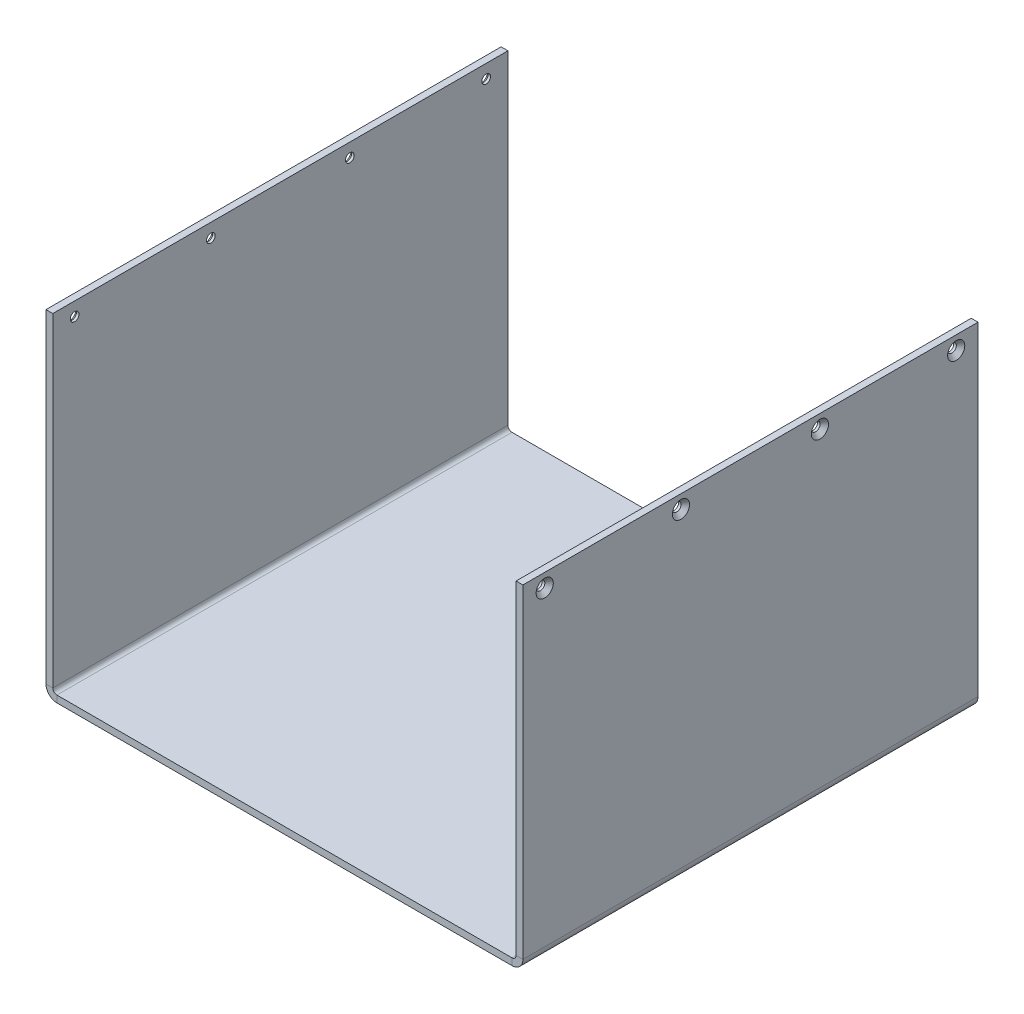
ISO-10303-21;
HEADER;
FILE_DESCRIPTION(('STEP AP214'),'2;1');
FILE_NAME('part.step','',(''),(''),'','','');
FILE_SCHEMA(('AUTOMOTIVE_DESIGN { 1 0 10303 214 1 1 1 1 }'));
ENDSEC;
DATA;
#1=APPLICATION_CONTEXT('core data for automotive mechanical design processes');
#2=APPLICATION_PROTOCOL_DEFINITION('international standard','automotive_design',2000,#1);
#3=PRODUCT_CONTEXT('',#1,'mechanical');
#4=PRODUCT('Part','Part','',(#3));
#5=PRODUCT_RELATED_PRODUCT_CATEGORY('part','',(#4));
#6=PRODUCT_DEFINITION_FORMATION('','',#4);
#7=PRODUCT_DEFINITION_CONTEXT('part definition',#1,'design');
#8=PRODUCT_DEFINITION('design','',#6,#7);
#9=PRODUCT_DEFINITION_SHAPE('','',#8);
#10=(LENGTH_UNIT() NAMED_UNIT(*) SI_UNIT(.MILLI.,.METRE.));
#11=(NAMED_UNIT(*) PLANE_ANGLE_UNIT() SI_UNIT($,.RADIAN.));
#12=(NAMED_UNIT(*) SI_UNIT($,.STERADIAN.) SOLID_ANGLE_UNIT());
#13=UNCERTAINTY_MEASURE_WITH_UNIT(LENGTH_MEASURE(1.E-05),#10,'distance_accuracy_value','');
#14=(GEOMETRIC_REPRESENTATION_CONTEXT(3) GLOBAL_UNCERTAINTY_ASSIGNED_CONTEXT((#13)) GLOBAL_UNIT_ASSIGNED_CONTEXT((#10,
#11,#12)) REPRESENTATION_CONTEXT('',''));
#15=CARTESIAN_POINT('',(0.,0.,0.));
#16=DIRECTION('',(0.,0.,1.));
#17=DIRECTION('',(1.,0.,0.));
#18=AXIS2_PLACEMENT_3D('',#15,#16,#17);
#19=CARTESIAN_POINT('',(124.731404958678,-4.45121620737105E-13,0.));
#20=DIRECTION('',(-1.,0.,0.));
#21=DIRECTION('',(0.,-1.,0.));
#22=AXIS2_PLACEMENT_3D('',#19,#20,#21);
#23=PLANE('',#22);
#24=CARTESIAN_POINT('',(124.731404958678,115.5,27.2665289256198));
#25=DIRECTION('',(1.,0.,0.));
#26=DIRECTION('',(0.,0.,-1.));
#27=AXIS2_PLACEMENT_3D('',#24,#25,#26);
#28=CIRCLE('',#27,3.15);
#29=CARTESIAN_POINT('',(124.731404958678,115.5,24.1165289256198));
#30=VERTEX_POINT('',#29);
#31=EDGE_CURVE('E752',#30,#30,#28,.T.);
#32=ORIENTED_EDGE('',*,*,#31,.F.);
#33=EDGE_LOOP('',(#32));
#34=FACE_BOUND('',#33,.T.);
#35=CARTESIAN_POINT('',(124.731404958678,115.5,78.2665289256198));
#36=DIRECTION('',(1.,0.,0.));
#37=DIRECTION('',(0.,0.,-1.));
#38=AXIS2_PLACEMENT_3D('',#35,#36,#37);
#39=CIRCLE('',#38,3.15);
#40=CARTESIAN_POINT('',(124.731404958678,115.5,75.1165289256198));
#41=VERTEX_POINT('',#40);
#42=EDGE_CURVE('E743',#41,#41,#39,.T.);
#43=ORIENTED_EDGE('',*,*,#42,.F.);
#44=EDGE_LOOP('',(#43));
#45=FACE_BOUND('',#44,.T.);
#46=DIRECTION('',(0.,0.,1.));
#47=VECTOR('',#46,1.);
#48=CARTESIAN_POINT('',(124.731404958678,1.49999999999998,0.));
#49=LINE('',#48,#47);
#50=CARTESIAN_POINT('',(124.731404958678,1.49999999999998,-30.7334710743802));
#51=VERTEX_POINT('',#50);
#52=CARTESIAN_POINT('',(124.731404958678,1.49999999999999,136.26652892562));
#53=VERTEX_POINT('',#52);
#54=EDGE_CURVE('E136',#51,#53,#49,.T.);
#55=ORIENTED_EDGE('',*,*,#54,.F.);
#56=DIRECTION('',(0.,1.,0.));
#57=VECTOR('',#56,1.);
#58=CARTESIAN_POINT('',(124.731404958678,120.5,-30.7334710743802));
#59=LINE('',#58,#57);
#60=CARTESIAN_POINT('',(124.731404958678,120.5,-30.7334710743802));
#61=VERTEX_POINT('',#60);
#62=EDGE_CURVE('E157',#51,#61,#59,.T.);
#63=ORIENTED_EDGE('',*,*,#62,.T.);
#64=DIRECTION('',(0.,0.,1.));
#65=VECTOR('',#64,1.);
#66=CARTESIAN_POINT('',(124.731404958678,120.5,136.26652892562));
#67=LINE('',#66,#65);
#68=CARTESIAN_POINT('',(124.731404958678,120.5,136.26652892562));
#69=VERTEX_POINT('',#68);
#70=EDGE_CURVE('E167',#61,#69,#67,.T.);
#71=ORIENTED_EDGE('',*,*,#70,.T.);
#72=DIRECTION('',(0.,-1.,0.));
#73=VECTOR('',#72,1.);
#74=CARTESIAN_POINT('',(124.731404958678,0.,136.26652892562));
#75=LINE('',#74,#73);
#76=EDGE_CURVE('E160',#69,#53,#75,.T.);
#77=ORIENTED_EDGE('',*,*,#76,.T.);
#78=EDGE_LOOP('',(#55,#63,#71,#77));
#79=FACE_BOUND('',#78,.T.);
#80=CARTESIAN_POINT('',(124.731404958678,115.5,128.26652892562));
#81=DIRECTION('',(1.,0.,0.));
#82=DIRECTION('',(0.,0.,-1.));
#83=AXIS2_PLACEMENT_3D('',#80,#81,#82);
#84=CIRCLE('',#83,3.15);
#85=CARTESIAN_POINT('',(124.731404958678,115.5,125.11652892562));
#86=VERTEX_POINT('',#85);
#87=EDGE_CURVE('E734',#86,#86,#84,.T.);
#88=ORIENTED_EDGE('',*,*,#87,.F.);
#89=EDGE_LOOP('',(#88));
#90=FACE_BOUND('',#89,.T.);
#91=CARTESIAN_POINT('',(124.731404958678,115.5,-22.7334710743802));
#92=DIRECTION('',(1.,0.,0.));
#93=DIRECTION('',(0.,0.,-1.));
#94=AXIS2_PLACEMENT_3D('',#91,#92,#93);
#95=CIRCLE('',#94,3.15);
#96=CARTESIAN_POINT('',(124.731404958678,115.5,-25.8834710743802));
#97=VERTEX_POINT('',#96);
#98=EDGE_CURVE('E761',#97,#97,#95,.T.);
#99=ORIENTED_EDGE('',*,*,#98,.F.);
#100=EDGE_LOOP('',(#99));
#101=FACE_BOUND('',#100,.T.);
#102=ADVANCED_FACE('F40',(#34,#45,#79,#90,#101),#23,.F.);
#103=CARTESIAN_POINT('',(-50.2685950413223,-1.73771630947329E-13,0.));
#104=DIRECTION('',(1.,0.,0.));
#105=DIRECTION('',(0.,1.,0.));
#106=AXIS2_PLACEMENT_3D('',#103,#104,#105);
#107=PLANE('',#106);
#108=CARTESIAN_POINT('',(-50.2685950413227,115.5,128.26652892562));
#109=DIRECTION('',(-1.,0.,0.));
#110=DIRECTION('',(0.,0.,1.));
#111=AXIS2_PLACEMENT_3D('',#108,#109,#110);
#112=CIRCLE('',#111,3.15);
#113=CARTESIAN_POINT('',(-50.2685950413227,115.5,131.41652892562));
#114=VERTEX_POINT('',#113);
#115=EDGE_CURVE('E725',#114,#114,#112,.T.);
#116=ORIENTED_EDGE('',*,*,#115,.F.);
#117=EDGE_LOOP('',(#116));
#118=FACE_BOUND('',#117,.T.);
#119=CARTESIAN_POINT('',(-50.2685950413227,115.5,27.2665289256198));
#120=DIRECTION('',(-1.,0.,0.));
#121=DIRECTION('',(0.,0.,1.));
#122=AXIS2_PLACEMENT_3D('',#119,#120,#121);
#123=CIRCLE('',#122,3.15);
#124=CARTESIAN_POINT('',(-50.2685950413227,115.5,30.4165289256198));
#125=VERTEX_POINT('',#124);
#126=EDGE_CURVE('E707',#125,#125,#123,.T.);
#127=ORIENTED_EDGE('',*,*,#126,.F.);
#128=EDGE_LOOP('',(#127));
#129=FACE_BOUND('',#128,.T.);
#130=DIRECTION('',(0.,0.,-1.));
#131=VECTOR('',#130,1.);
#132=CARTESIAN_POINT('',(-50.2685950413223,1.49999999999998,0.));
#133=LINE('',#132,#131);
#134=CARTESIAN_POINT('',(-50.2685950413223,1.49999999999998,136.26652892562));
#135=VERTEX_POINT('',#134);
#136=CARTESIAN_POINT('',(-50.2685950413223,1.49999999999998,-30.7334710743802));
#137=VERTEX_POINT('',#136);
#138=EDGE_CURVE('E203',#135,#137,#133,.T.);
#139=ORIENTED_EDGE('',*,*,#138,.F.);
#140=DIRECTION('',(0.,1.,0.));
#141=VECTOR('',#140,1.);
#142=CARTESIAN_POINT('',(-50.2685950413227,120.5,136.26652892562));
#143=LINE('',#142,#141);
#144=CARTESIAN_POINT('',(-50.2685950413227,120.5,136.26652892562));
#145=VERTEX_POINT('',#144);
#146=EDGE_CURVE('E208',#135,#145,#143,.T.);
#147=ORIENTED_EDGE('',*,*,#146,.T.);
#148=DIRECTION('',(0.,0.,-1.));
#149=VECTOR('',#148,1.);
#150=CARTESIAN_POINT('',(-50.2685950413227,120.5,-30.7334710743802));
#151=LINE('',#150,#149);
#152=CARTESIAN_POINT('',(-50.2685950413227,120.5,-30.7334710743802));
#153=VERTEX_POINT('',#152);
#154=EDGE_CURVE('E210',#145,#153,#151,.T.);
#155=ORIENTED_EDGE('',*,*,#154,.T.);
#156=DIRECTION('',(0.,-1.,0.));
#157=VECTOR('',#156,1.);
#158=CARTESIAN_POINT('',(-50.2685950413223,0.,-30.7334710743802));
#159=LINE('',#158,#157);
#160=EDGE_CURVE('E213',#153,#137,#159,.T.);
#161=ORIENTED_EDGE('',*,*,#160,.T.);
#162=EDGE_LOOP('',(#139,#147,#155,#161));
#163=FACE_BOUND('',#162,.T.);
#164=CARTESIAN_POINT('',(-50.2685950413227,115.5,-22.7334710743802));
#165=DIRECTION('',(-1.,0.,0.));
#166=DIRECTION('',(0.,0.,1.));
#167=AXIS2_PLACEMENT_3D('',#164,#165,#166);
#168=CIRCLE('',#167,3.15);
#169=CARTESIAN_POINT('',(-50.2685950413227,115.5,-19.5834710743802));
#170=VERTEX_POINT('',#169);
#171=EDGE_CURVE('E698',#170,#170,#168,.T.);
#172=ORIENTED_EDGE('',*,*,#171,.F.);
#173=EDGE_LOOP('',(#172));
#174=FACE_BOUND('',#173,.T.);
#175=CARTESIAN_POINT('',(-50.2685950413227,115.5,78.2665289256198));
#176=DIRECTION('',(-1.,0.,0.));
#177=DIRECTION('',(0.,0.,1.));
#178=AXIS2_PLACEMENT_3D('',#175,#176,#177);
#179=CIRCLE('',#178,3.15);
#180=CARTESIAN_POINT('',(-50.2685950413227,115.5,81.4165289256198));
#181=VERTEX_POINT('',#180);
#182=EDGE_CURVE('E716',#181,#181,#179,.T.);
#183=ORIENTED_EDGE('',*,*,#182,.F.);
#184=EDGE_LOOP('',(#183));
#185=FACE_BOUND('',#184,.T.);
#186=ADVANCED_FACE('F267',(#118,#129,#163,#174,#185),#107,.F.);
#187=CARTESIAN_POINT('',(0.,-2.5,0.));
#188=DIRECTION('',(0.,1.,0.));
#189=DIRECTION('',(0.,0.,1.));
#190=AXIS2_PLACEMENT_3D('',#187,#188,#189);
#191=PLANE('',#190);
#192=DIRECTION('',(0.,0.,-1.));
#193=VECTOR('',#192,1.);
#194=CARTESIAN_POINT('',(120.731404958678,-2.50000000000004,-30.7334710743802));
#195=LINE('',#194,#193);
#196=CARTESIAN_POINT('',(120.731404958678,-2.50000000000004,-30.7334710743802));
#197=VERTEX_POINT('',#196);
#198=CARTESIAN_POINT('',(120.731404958678,-2.5,136.26652892562));
#199=VERTEX_POINT('',#198);
#200=EDGE_CURVE('E138',#197,#199,#195,.F.);
#201=ORIENTED_EDGE('',*,*,#200,.T.);
#202=DIRECTION('',(1.,0.,0.));
#203=VECTOR('',#202,1.);
#204=CARTESIAN_POINT('',(-47.7685950413223,-2.5,136.26652892562));
#205=LINE('',#204,#203);
#206=CARTESIAN_POINT('',(-46.2685950413223,-2.50000000000003,136.26652892562));
#207=VERTEX_POINT('',#206);
#208=EDGE_CURVE('E49',#207,#199,#205,.T.);
#209=ORIENTED_EDGE('',*,*,#208,.F.);
#210=DIRECTION('',(0.,0.,1.));
#211=VECTOR('',#210,1.);
#212=CARTESIAN_POINT('',(-46.2685950413223,-2.50000000000003,136.26652892562));
#213=LINE('',#212,#211);
#214=CARTESIAN_POINT('',(-46.2685950413223,-2.5,-30.7334710743802));
#215=VERTEX_POINT('',#214);
#216=EDGE_CURVE('E228',#207,#215,#213,.F.);
#217=ORIENTED_EDGE('',*,*,#216,.T.);
#218=DIRECTION('',(-1.,0.,0.));
#219=VECTOR('',#218,1.);
#220=CARTESIAN_POINT('',(-47.7685950413223,-2.5,-30.7334710743802));
#221=LINE('',#220,#219);
#222=EDGE_CURVE('E11',#197,#215,#221,.T.);
#223=ORIENTED_EDGE('',*,*,#222,.F.);
#224=EDGE_LOOP('',(#201,#209,#217,#223));
#225=FACE_BOUND('',#224,.T.);
#226=ADVANCED_FACE('F302',(#225),#191,.F.);
#227=CARTESIAN_POINT('',(0.,0.,0.));
#228=DIRECTION('',(0.,1.,0.));
#229=DIRECTION('',(0.,0.,1.));
#230=AXIS2_PLACEMENT_3D('',#227,#228,#229);
#231=PLANE('',#230);
#232=DIRECTION('',(1.,0.,0.));
#233=VECTOR('',#232,1.);
#234=CARTESIAN_POINT('',(-47.7685950413223,0.,136.26652892562));
#235=LINE('',#234,#233);
#236=CARTESIAN_POINT('',(-46.2685950413223,0.,136.26652892562));
#237=VERTEX_POINT('',#236);
#238=CARTESIAN_POINT('',(120.731404958678,0.,136.26652892562));
#239=VERTEX_POINT('',#238);
#240=EDGE_CURVE('E246',#237,#239,#235,.T.);
#241=ORIENTED_EDGE('',*,*,#240,.T.);
#242=DIRECTION('',(0.,0.,-1.));
#243=VECTOR('',#242,1.);
#244=CARTESIAN_POINT('',(120.731404958678,0.,-30.7334710743802));
#245=LINE('',#244,#243);
#246=CARTESIAN_POINT('',(120.731404958678,0.,-30.7334710743802));
#247=VERTEX_POINT('',#246);
#248=EDGE_CURVE('E189',#247,#239,#245,.F.);
#249=ORIENTED_EDGE('',*,*,#248,.F.);
#250=DIRECTION('',(-1.,0.,0.));
#251=VECTOR('',#250,1.);
#252=CARTESIAN_POINT('',(-47.7685950413223,0.,-30.7334710743802));
#253=LINE('',#252,#251);
#254=CARTESIAN_POINT('',(-46.2685950413223,0.,-30.7334710743802));
#255=VERTEX_POINT('',#254);
#256=EDGE_CURVE('E44',#247,#255,#253,.T.);
#257=ORIENTED_EDGE('',*,*,#256,.T.);
#258=DIRECTION('',(0.,0.,1.));
#259=VECTOR('',#258,1.);
#260=CARTESIAN_POINT('',(-46.2685950413223,0.,136.26652892562));
#261=LINE('',#260,#259);
#262=EDGE_CURVE('E57',#237,#255,#261,.F.);
#263=ORIENTED_EDGE('',*,*,#262,.F.);
#264=EDGE_LOOP('',(#241,#249,#257,#263));
#265=FACE_BOUND('',#264,.T.);
#266=ADVANCED_FACE('F251',(#265),#231,.T.);
#267=CARTESIAN_POINT('',(-47.7685950413223,-2.5,-30.7334710743802));
#268=DIRECTION('',(0.,0.,-1.));
#269=DIRECTION('',(-1.,0.,0.));
#270=AXIS2_PLACEMENT_3D('',#267,#268,#269);
#271=PLANE('',#270);
#272=ORIENTED_EDGE('',*,*,#256,.F.);
#273=DIRECTION('',(0.,-1.,0.));
#274=VECTOR('',#273,1.);
#275=CARTESIAN_POINT('',(120.731404958678,0.,-30.7334710743802));
#276=LINE('',#275,#274);
#277=EDGE_CURVE('E185',#247,#197,#276,.T.);
#278=ORIENTED_EDGE('',*,*,#277,.T.);
#279=ORIENTED_EDGE('',*,*,#222,.T.);
#280=DIRECTION('',(0.,-1.,0.));
#281=VECTOR('',#280,1.);
#282=CARTESIAN_POINT('',(-46.2685950413223,0.,-30.7334710743802));
#283=LINE('',#282,#281);
#284=EDGE_CURVE('E243',#255,#215,#283,.T.);
#285=ORIENTED_EDGE('',*,*,#284,.F.);
#286=EDGE_LOOP('',(#272,#278,#279,#285));
#287=FACE_BOUND('',#286,.T.);
#288=ADVANCED_FACE('F252',(#287),#271,.T.);
#289=CARTESIAN_POINT('',(-47.7685950413223,-2.5,136.26652892562));
#290=DIRECTION('',(0.,0.,1.));
#291=DIRECTION('',(1.,0.,0.));
#292=AXIS2_PLACEMENT_3D('',#289,#290,#291);
#293=PLANE('',#292);
#294=DIRECTION('',(0.,-1.,0.));
#295=VECTOR('',#294,1.);
#296=CARTESIAN_POINT('',(120.731404958678,0.,136.26652892562));
#297=LINE('',#296,#295);
#298=EDGE_CURVE('E193',#239,#199,#297,.T.);
#299=ORIENTED_EDGE('',*,*,#298,.F.);
#300=ORIENTED_EDGE('',*,*,#240,.F.);
#301=DIRECTION('',(0.,-1.,0.));
#302=VECTOR('',#301,1.);
#303=CARTESIAN_POINT('',(-46.2685950413223,0.,136.26652892562));
#304=LINE('',#303,#302);
#305=EDGE_CURVE('E234',#237,#207,#304,.T.);
#306=ORIENTED_EDGE('',*,*,#305,.T.);
#307=ORIENTED_EDGE('',*,*,#208,.T.);
#308=EDGE_LOOP('',(#299,#300,#306,#307));
#309=FACE_BOUND('',#308,.T.);
#310=ADVANCED_FACE('F42',(#309),#293,.T.);
#311=CARTESIAN_POINT('',(-46.2685950413223,1.5,-30.7334710743802));
#312=DIRECTION('',(0.,0.,-1.));
#313=DIRECTION('',(-1.,0.,0.));
#314=AXIS2_PLACEMENT_3D('',#311,#312,#313);
#315=PLANE('',#314);
#316=DIRECTION('',(-1.,0.,0.));
#317=VECTOR('',#316,1.);
#318=CARTESIAN_POINT('',(-47.7685950413223,1.49999999999999,-30.7334710743802));
#319=LINE('',#318,#317);
#320=CARTESIAN_POINT('',(-47.7685950413223,1.49999999999999,-30.7334710743802));
#321=VERTEX_POINT('',#320);
#322=EDGE_CURVE('E196',#321,#137,#319,.T.);
#323=ORIENTED_EDGE('',*,*,#322,.F.);
#324=CARTESIAN_POINT('',(-46.2685950413223,1.5,-30.7334710743802));
#325=DIRECTION('',(0.,0.,1.));
#326=DIRECTION('',(1.,0.,0.));
#327=AXIS2_PLACEMENT_3D('',#324,#325,#326);
#328=CIRCLE('',#327,1.50000000000002);
#329=EDGE_CURVE('E237',#255,#321,#328,.F.);
#330=ORIENTED_EDGE('',*,*,#329,.F.);
#331=ORIENTED_EDGE('',*,*,#284,.T.);
#332=CARTESIAN_POINT('',(-46.2685950413223,1.5,-30.7334710743802));
#333=DIRECTION('',(0.,0.,1.));
#334=DIRECTION('',(1.,0.,0.));
#335=AXIS2_PLACEMENT_3D('',#332,#333,#334);
#336=CIRCLE('',#335,4.00000000000002);
#337=EDGE_CURVE('E230',#215,#137,#336,.F.);
#338=ORIENTED_EDGE('',*,*,#337,.T.);
#339=EDGE_LOOP('',(#323,#330,#331,#338));
#340=FACE_BOUND('',#339,.T.);
#341=ADVANCED_FACE('F260',(#340),#315,.T.);
#342=CARTESIAN_POINT('',(-46.2685950413223,1.5,136.26652892562));
#343=DIRECTION('',(0.,0.,-1.));
#344=DIRECTION('',(-1.,0.,0.));
#345=AXIS2_PLACEMENT_3D('',#342,#343,#344);
#346=PLANE('',#345);
#347=CARTESIAN_POINT('',(-46.2685950413223,1.5,136.26652892562));
#348=DIRECTION('',(0.,0.,1.));
#349=DIRECTION('',(1.,0.,0.));
#350=AXIS2_PLACEMENT_3D('',#347,#348,#349);
#351=CIRCLE('',#350,1.50000000000002);
#352=CARTESIAN_POINT('',(-47.7685950413223,1.49999999999999,136.26652892562));
#353=VERTEX_POINT('',#352);
#354=EDGE_CURVE('E227',#353,#237,#351,.T.);
#355=ORIENTED_EDGE('',*,*,#354,.F.);
#356=DIRECTION('',(-1.,0.,0.));
#357=VECTOR('',#356,1.);
#358=CARTESIAN_POINT('',(-47.7685950413223,1.49999999999999,136.26652892562));
#359=LINE('',#358,#357);
#360=EDGE_CURVE('E200',#353,#135,#359,.T.);
#361=ORIENTED_EDGE('',*,*,#360,.T.);
#362=CARTESIAN_POINT('',(-46.2685950413223,1.5,136.26652892562));
#363=DIRECTION('',(0.,0.,1.));
#364=DIRECTION('',(1.,0.,0.));
#365=AXIS2_PLACEMENT_3D('',#362,#363,#364);
#366=CIRCLE('',#365,4.00000000000002);
#367=EDGE_CURVE('E231',#135,#207,#366,.T.);
#368=ORIENTED_EDGE('',*,*,#367,.T.);
#369=ORIENTED_EDGE('',*,*,#305,.F.);
#370=EDGE_LOOP('',(#355,#361,#368,#369));
#371=FACE_BOUND('',#370,.T.);
#372=ADVANCED_FACE('F282',(#371),#346,.F.);
#373=CARTESIAN_POINT('',(-46.2685950413223,1.5,136.26652892562));
#374=DIRECTION('',(0.,0.,1.));
#375=DIRECTION('',(-1.,0.,0.));
#376=AXIS2_PLACEMENT_3D('',#373,#374,#375);
#377=CYLINDRICAL_SURFACE('',#376,4.00000000000002);
#378=ORIENTED_EDGE('',*,*,#216,.F.);
#379=ORIENTED_EDGE('',*,*,#367,.F.);
#380=ORIENTED_EDGE('',*,*,#138,.T.);
#381=ORIENTED_EDGE('',*,*,#337,.F.);
#382=EDGE_LOOP('',(#378,#379,#380,#381));
#383=FACE_BOUND('',#382,.T.);
#384=ADVANCED_FACE('F292',(#383),#377,.T.);
#385=CARTESIAN_POINT('',(-46.2685950413223,1.5,136.26652892562));
#386=DIRECTION('',(0.,0.,1.));
#387=DIRECTION('',(-1.,0.,0.));
#388=AXIS2_PLACEMENT_3D('',#385,#386,#387);
#389=CYLINDRICAL_SURFACE('',#388,1.50000000000002);
#390=ORIENTED_EDGE('',*,*,#262,.T.);
#391=ORIENTED_EDGE('',*,*,#329,.T.);
#392=DIRECTION('',(0.,0.,1.));
#393=VECTOR('',#392,1.);
#394=CARTESIAN_POINT('',(-47.7685950413223,1.49999999999999,-30.7334710743802));
#395=LINE('',#394,#393);
#396=EDGE_CURVE('E198',#321,#353,#395,.T.);
#397=ORIENTED_EDGE('',*,*,#396,.T.);
#398=ORIENTED_EDGE('',*,*,#354,.T.);
#399=EDGE_LOOP('',(#390,#391,#397,#398));
#400=FACE_BOUND('',#399,.T.);
#401=ADVANCED_FACE('F257',(#400),#389,.F.);
#402=CARTESIAN_POINT('',(-50.2685950413227,120.5,136.26652892562));
#403=DIRECTION('',(0.,0.,-1.));
#404=DIRECTION('',(-1.,0.,0.));
#405=AXIS2_PLACEMENT_3D('',#402,#403,#404);
#406=PLANE('',#405);
#407=ORIENTED_EDGE('',*,*,#360,.F.);
#408=DIRECTION('',(0.,1.,0.));
#409=VECTOR('',#408,1.);
#410=CARTESIAN_POINT('',(-47.7685950413227,120.5,136.26652892562));
#411=LINE('',#410,#409);
#412=CARTESIAN_POINT('',(-47.7685950413227,120.5,136.26652892562));
#413=VERTEX_POINT('',#412);
#414=EDGE_CURVE('E207',#353,#413,#411,.T.);
#415=ORIENTED_EDGE('',*,*,#414,.T.);
#416=DIRECTION('',(1.,0.,0.));
#417=VECTOR('',#416,1.);
#418=CARTESIAN_POINT('',(-50.2685950413227,120.5,136.26652892562));
#419=LINE('',#418,#417);
#420=EDGE_CURVE('E224',#145,#413,#419,.T.);
#421=ORIENTED_EDGE('',*,*,#420,.F.);
#422=ORIENTED_EDGE('',*,*,#146,.F.);
#423=EDGE_LOOP('',(#407,#415,#421,#422));
#424=FACE_BOUND('',#423,.T.);
#425=ADVANCED_FACE('F284',(#424),#406,.F.);
#426=CARTESIAN_POINT('',(-50.2685950413223,0.,-30.7334710743802));
#427=DIRECTION('',(0.,0.,1.));
#428=DIRECTION('',(1.,0.,0.));
#429=AXIS2_PLACEMENT_3D('',#426,#427,#428);
#430=PLANE('',#429);
#431=ORIENTED_EDGE('',*,*,#322,.T.);
#432=ORIENTED_EDGE('',*,*,#160,.F.);
#433=DIRECTION('',(1.,0.,0.));
#434=VECTOR('',#433,1.);
#435=CARTESIAN_POINT('',(-50.2685950413227,120.5,-30.7334710743802));
#436=LINE('',#435,#434);
#437=CARTESIAN_POINT('',(-47.7685950413227,120.5,-30.7334710743802));
#438=VERTEX_POINT('',#437);
#439=EDGE_CURVE('E216',#153,#438,#436,.T.);
#440=ORIENTED_EDGE('',*,*,#439,.T.);
#441=DIRECTION('',(0.,-1.,0.));
#442=VECTOR('',#441,1.);
#443=CARTESIAN_POINT('',(-47.7685950413223,0.,-30.7334710743802));
#444=LINE('',#443,#442);
#445=EDGE_CURVE('E211',#438,#321,#444,.T.);
#446=ORIENTED_EDGE('',*,*,#445,.T.);
#447=EDGE_LOOP('',(#431,#432,#440,#446));
#448=FACE_BOUND('',#447,.T.);
#449=ADVANCED_FACE('F263',(#448),#430,.F.);
#450=CARTESIAN_POINT('',(-47.7685950413223,-1.65042927600221E-13,0.));
#451=DIRECTION('',(1.,0.,0.));
#452=DIRECTION('',(0.,1.,0.));
#453=AXIS2_PLACEMENT_3D('',#450,#451,#452);
#454=PLANE('',#453);
#455=CARTESIAN_POINT('',(-47.7685950413227,115.5,128.26652892562));
#456=DIRECTION('',(1.,0.,0.));
#457=DIRECTION('',(0.,1.,0.));
#458=AXIS2_PLACEMENT_3D('',#455,#456,#457);
#459=CIRCLE('',#458,1.6);
#460=CARTESIAN_POINT('',(-47.7685950413227,117.1,128.26652892562));
#461=VERTEX_POINT('',#460);
#462=EDGE_CURVE('E719',#461,#461,#459,.T.);
#463=ORIENTED_EDGE('',*,*,#462,.F.);
#464=EDGE_LOOP('',(#463));
#465=FACE_BOUND('',#464,.T.);
#466=CARTESIAN_POINT('',(-47.7685950413227,115.5,78.2665289256198));
#467=DIRECTION('',(1.,0.,0.));
#468=DIRECTION('',(0.,1.,0.));
#469=AXIS2_PLACEMENT_3D('',#466,#467,#468);
#470=CIRCLE('',#469,1.6);
#471=CARTESIAN_POINT('',(-47.7685950413227,117.1,78.2665289256198));
#472=VERTEX_POINT('',#471);
#473=EDGE_CURVE('E710',#472,#472,#470,.T.);
#474=ORIENTED_EDGE('',*,*,#473,.F.);
#475=EDGE_LOOP('',(#474));
#476=FACE_BOUND('',#475,.T.);
#477=CARTESIAN_POINT('',(-47.7685950413227,115.5,27.2665289256198));
#478=DIRECTION('',(1.,0.,0.));
#479=DIRECTION('',(0.,1.,0.));
#480=AXIS2_PLACEMENT_3D('',#477,#478,#479);
#481=CIRCLE('',#480,1.6);
#482=CARTESIAN_POINT('',(-47.7685950413227,117.1,27.2665289256198));
#483=VERTEX_POINT('',#482);
#484=EDGE_CURVE('E701',#483,#483,#481,.T.);
#485=ORIENTED_EDGE('',*,*,#484,.F.);
#486=EDGE_LOOP('',(#485));
#487=FACE_BOUND('',#486,.T.);
#488=CARTESIAN_POINT('',(-47.7685950413227,115.5,-22.7334710743802));
#489=DIRECTION('',(1.,0.,0.));
#490=DIRECTION('',(0.,1.,0.));
#491=AXIS2_PLACEMENT_3D('',#488,#489,#490);
#492=CIRCLE('',#491,1.6);
#493=CARTESIAN_POINT('',(-47.7685950413227,117.1,-22.7334710743802));
#494=VERTEX_POINT('',#493);
#495=EDGE_CURVE('E691',#494,#494,#492,.T.);
#496=ORIENTED_EDGE('',*,*,#495,.F.);
#497=EDGE_LOOP('',(#496));
#498=FACE_BOUND('',#497,.T.);
#499=ORIENTED_EDGE('',*,*,#414,.F.);
#500=ORIENTED_EDGE('',*,*,#396,.F.);
#501=ORIENTED_EDGE('',*,*,#445,.F.);
#502=DIRECTION('',(0.,0.,-1.));
#503=VECTOR('',#502,1.);
#504=CARTESIAN_POINT('',(-47.7685950413227,120.5,-30.7334710743802));
#505=LINE('',#504,#503);
#506=EDGE_CURVE('E218',#413,#438,#505,.T.);
#507=ORIENTED_EDGE('',*,*,#506,.F.);
#508=EDGE_LOOP('',(#499,#500,#501,#507));
#509=FACE_BOUND('',#508,.T.);
#510=ADVANCED_FACE('F278',(#465,#476,#487,#498,#509),#454,.T.);
#511=CARTESIAN_POINT('',(-50.2685950413227,120.5,-30.7334710743802));
#512=DIRECTION('',(0.,-1.,0.));
#513=DIRECTION('',(1.,0.,0.));
#514=AXIS2_PLACEMENT_3D('',#511,#512,#513);
#515=PLANE('',#514);
#516=ORIENTED_EDGE('',*,*,#506,.T.);
#517=ORIENTED_EDGE('',*,*,#439,.F.);
#518=ORIENTED_EDGE('',*,*,#154,.F.);
#519=ORIENTED_EDGE('',*,*,#420,.T.);
#520=EDGE_LOOP('',(#516,#517,#518,#519));
#521=FACE_BOUND('',#520,.T.);
#522=ADVANCED_FACE('F274',(#521),#515,.F.);
#523=CARTESIAN_POINT('',(120.731404958678,1.50000000000001,136.26652892562));
#524=DIRECTION('',(0.,0.,1.));
#525=DIRECTION('',(0.,-1.,0.));
#526=AXIS2_PLACEMENT_3D('',#523,#524,#525);
#527=PLANE('',#526);
#528=DIRECTION('',(1.,0.,0.));
#529=VECTOR('',#528,1.);
#530=CARTESIAN_POINT('',(122.231404958678,1.5,136.26652892562));
#531=LINE('',#530,#529);
#532=CARTESIAN_POINT('',(122.231404958678,1.5,136.26652892562));
#533=VERTEX_POINT('',#532);
#534=EDGE_CURVE('E684',#533,#53,#531,.T.);
#535=ORIENTED_EDGE('',*,*,#534,.F.);
#536=CARTESIAN_POINT('',(120.731404958678,1.50000000000001,136.26652892562));
#537=DIRECTION('',(0.,0.,-1.));
#538=DIRECTION('',(0.,1.,0.));
#539=AXIS2_PLACEMENT_3D('',#536,#537,#538);
#540=CIRCLE('',#539,1.50000000000003);
#541=EDGE_CURVE('E141',#239,#533,#540,.F.);
#542=ORIENTED_EDGE('',*,*,#541,.F.);
#543=ORIENTED_EDGE('',*,*,#298,.T.);
#544=CARTESIAN_POINT('',(120.731404958678,1.50000000000001,136.26652892562));
#545=DIRECTION('',(0.,0.,-1.));
#546=DIRECTION('',(0.,1.,0.));
#547=AXIS2_PLACEMENT_3D('',#544,#545,#546);
#548=CIRCLE('',#547,4.00000000000003);
#549=EDGE_CURVE('E184',#199,#53,#548,.F.);
#550=ORIENTED_EDGE('',*,*,#549,.T.);
#551=EDGE_LOOP('',(#535,#542,#543,#550));
#552=FACE_BOUND('',#551,.T.);
#553=ADVANCED_FACE('F331',(#552),#527,.T.);
#554=CARTESIAN_POINT('',(120.731404958678,1.49999999999999,-30.7334710743802));
#555=DIRECTION('',(0.,0.,1.));
#556=DIRECTION('',(0.,-1.,0.));
#557=AXIS2_PLACEMENT_3D('',#554,#555,#556);
#558=PLANE('',#557);
#559=CARTESIAN_POINT('',(120.731404958678,1.49999999999999,-30.7334710743802));
#560=DIRECTION('',(0.,0.,-1.));
#561=DIRECTION('',(0.,1.,0.));
#562=AXIS2_PLACEMENT_3D('',#559,#560,#561);
#563=CIRCLE('',#562,1.50000000000003);
#564=CARTESIAN_POINT('',(122.231404958678,1.49999999999999,-30.7334710743802));
#565=VERTEX_POINT('',#564);
#566=EDGE_CURVE('E148',#565,#247,#563,.T.);
#567=ORIENTED_EDGE('',*,*,#566,.F.);
#568=DIRECTION('',(1.,0.,0.));
#569=VECTOR('',#568,1.);
#570=CARTESIAN_POINT('',(122.231404958678,1.49999999999999,-30.7334710743802));
#571=LINE('',#570,#569);
#572=EDGE_CURVE('E145',#565,#51,#571,.T.);
#573=ORIENTED_EDGE('',*,*,#572,.T.);
#574=CARTESIAN_POINT('',(120.731404958678,1.49999999999999,-30.7334710743802));
#575=DIRECTION('',(0.,0.,-1.));
#576=DIRECTION('',(0.,1.,0.));
#577=AXIS2_PLACEMENT_3D('',#574,#575,#576);
#578=CIRCLE('',#577,4.00000000000003);
#579=EDGE_CURVE('E131',#51,#197,#578,.T.);
#580=ORIENTED_EDGE('',*,*,#579,.T.);
#581=ORIENTED_EDGE('',*,*,#277,.F.);
#582=EDGE_LOOP('',(#567,#573,#580,#581));
#583=FACE_BOUND('',#582,.T.);
#584=ADVANCED_FACE('F146',(#583),#558,.F.);
#585=CARTESIAN_POINT('',(120.731404958678,1.49999999999999,-30.7334710743802));
#586=DIRECTION('',(0.,0.,-1.));
#587=DIRECTION('',(1.,0.,0.));
#588=AXIS2_PLACEMENT_3D('',#585,#586,#587);
#589=CYLINDRICAL_SURFACE('',#588,4.00000000000003);
#590=ORIENTED_EDGE('',*,*,#200,.F.);
#591=ORIENTED_EDGE('',*,*,#579,.F.);
#592=ORIENTED_EDGE('',*,*,#54,.T.);
#593=ORIENTED_EDGE('',*,*,#549,.F.);
#594=EDGE_LOOP('',(#590,#591,#592,#593));
#595=FACE_BOUND('',#594,.T.);
#596=ADVANCED_FACE('F133',(#595),#589,.T.);
#597=CARTESIAN_POINT('',(120.731404958678,1.49999999999999,-30.7334710743802));
#598=DIRECTION('',(0.,0.,-1.));
#599=DIRECTION('',(1.,0.,0.));
#600=AXIS2_PLACEMENT_3D('',#597,#598,#599);
#601=CYLINDRICAL_SURFACE('',#600,1.50000000000003);
#602=ORIENTED_EDGE('',*,*,#248,.T.);
#603=ORIENTED_EDGE('',*,*,#541,.T.);
#604=DIRECTION('',(0.,0.,-1.));
#605=VECTOR('',#604,1.);
#606=CARTESIAN_POINT('',(122.231404958678,1.5,136.26652892562));
#607=LINE('',#606,#605);
#608=EDGE_CURVE('E152',#533,#565,#607,.T.);
#609=ORIENTED_EDGE('',*,*,#608,.T.);
#610=ORIENTED_EDGE('',*,*,#566,.T.);
#611=EDGE_LOOP('',(#602,#603,#609,#610));
#612=FACE_BOUND('',#611,.T.);
#613=ADVANCED_FACE('F325',(#612),#601,.F.);
#614=CARTESIAN_POINT('',(124.731404958678,120.5,-30.7334710743802));
#615=DIRECTION('',(0.,0.,1.));
#616=DIRECTION('',(1.,0.,0.));
#617=AXIS2_PLACEMENT_3D('',#614,#615,#616);
#618=PLANE('',#617);
#619=ORIENTED_EDGE('',*,*,#572,.F.);
#620=DIRECTION('',(0.,1.,0.));
#621=VECTOR('',#620,1.);
#622=CARTESIAN_POINT('',(122.231404958678,120.5,-30.7334710743802));
#623=LINE('',#622,#621);
#624=CARTESIAN_POINT('',(122.231404958678,120.5,-30.7334710743802));
#625=VERTEX_POINT('',#624);
#626=EDGE_CURVE('E161',#565,#625,#623,.T.);
#627=ORIENTED_EDGE('',*,*,#626,.T.);
#628=DIRECTION('',(-1.,0.,0.));
#629=VECTOR('',#628,1.);
#630=CARTESIAN_POINT('',(124.731404958678,120.5,-30.7334710743802));
#631=LINE('',#630,#629);
#632=EDGE_CURVE('E165',#61,#625,#631,.T.);
#633=ORIENTED_EDGE('',*,*,#632,.F.);
#634=ORIENTED_EDGE('',*,*,#62,.F.);
#635=EDGE_LOOP('',(#619,#627,#633,#634));
#636=FACE_BOUND('',#635,.T.);
#637=ADVANCED_FACE('F163',(#636),#618,.F.);
#638=CARTESIAN_POINT('',(124.731404958678,0.,136.26652892562));
#639=DIRECTION('',(0.,0.,-1.));
#640=DIRECTION('',(-1.,0.,0.));
#641=AXIS2_PLACEMENT_3D('',#638,#639,#640);
#642=PLANE('',#641);
#643=ORIENTED_EDGE('',*,*,#534,.T.);
#644=ORIENTED_EDGE('',*,*,#76,.F.);
#645=DIRECTION('',(-1.,0.,0.));
#646=VECTOR('',#645,1.);
#647=CARTESIAN_POINT('',(124.731404958678,120.5,136.26652892562));
#648=LINE('',#647,#646);
#649=CARTESIAN_POINT('',(122.231404958678,120.5,136.26652892562));
#650=VERTEX_POINT('',#649);
#651=EDGE_CURVE('E177',#69,#650,#648,.T.);
#652=ORIENTED_EDGE('',*,*,#651,.T.);
#653=DIRECTION('',(0.,-1.,0.));
#654=VECTOR('',#653,1.);
#655=CARTESIAN_POINT('',(122.231404958678,0.,136.26652892562));
#656=LINE('',#655,#654);
#657=EDGE_CURVE('E168',#650,#533,#656,.T.);
#658=ORIENTED_EDGE('',*,*,#657,.T.);
#659=EDGE_LOOP('',(#643,#644,#652,#658));
#660=FACE_BOUND('',#659,.T.);
#661=ADVANCED_FACE('F315',(#660),#642,.F.);
#662=CARTESIAN_POINT('',(122.231404958678,-4.36392917389997E-13,0.));
#663=DIRECTION('',(-1.,0.,0.));
#664=DIRECTION('',(0.,-1.,0.));
#665=AXIS2_PLACEMENT_3D('',#662,#663,#664);
#666=PLANE('',#665);
#667=CARTESIAN_POINT('',(122.231404958678,115.5,-22.7334710743802));
#668=DIRECTION('',(-1.,0.,0.));
#669=DIRECTION('',(0.,-1.,0.));
#670=AXIS2_PLACEMENT_3D('',#667,#668,#669);
#671=CIRCLE('',#670,1.6);
#672=CARTESIAN_POINT('',(122.231404958678,113.9,-22.7334710743802));
#673=VERTEX_POINT('',#672);
#674=EDGE_CURVE('E755',#673,#673,#671,.T.);
#675=ORIENTED_EDGE('',*,*,#674,.F.);
#676=EDGE_LOOP('',(#675));
#677=FACE_BOUND('',#676,.T.);
#678=CARTESIAN_POINT('',(122.231404958678,115.5,27.2665289256198));
#679=DIRECTION('',(-1.,0.,0.));
#680=DIRECTION('',(0.,-1.,0.));
#681=AXIS2_PLACEMENT_3D('',#678,#679,#680);
#682=CIRCLE('',#681,1.6);
#683=CARTESIAN_POINT('',(122.231404958678,113.9,27.2665289256198));
#684=VERTEX_POINT('',#683);
#685=EDGE_CURVE('E746',#684,#684,#682,.T.);
#686=ORIENTED_EDGE('',*,*,#685,.F.);
#687=EDGE_LOOP('',(#686));
#688=FACE_BOUND('',#687,.T.);
#689=CARTESIAN_POINT('',(122.231404958678,115.5,78.2665289256198));
#690=DIRECTION('',(-1.,0.,0.));
#691=DIRECTION('',(0.,-1.,0.));
#692=AXIS2_PLACEMENT_3D('',#689,#690,#691);
#693=CIRCLE('',#692,1.6);
#694=CARTESIAN_POINT('',(122.231404958678,113.9,78.2665289256198));
#695=VERTEX_POINT('',#694);
#696=EDGE_CURVE('E737',#695,#695,#693,.T.);
#697=ORIENTED_EDGE('',*,*,#696,.F.);
#698=EDGE_LOOP('',(#697));
#699=FACE_BOUND('',#698,.T.);
#700=CARTESIAN_POINT('',(122.231404958678,115.5,128.26652892562));
#701=DIRECTION('',(-1.,0.,0.));
#702=DIRECTION('',(0.,-1.,0.));
#703=AXIS2_PLACEMENT_3D('',#700,#701,#702);
#704=CIRCLE('',#703,1.6);
#705=CARTESIAN_POINT('',(122.231404958678,113.9,128.26652892562));
#706=VERTEX_POINT('',#705);
#707=EDGE_CURVE('E728',#706,#706,#704,.T.);
#708=ORIENTED_EDGE('',*,*,#707,.F.);
#709=EDGE_LOOP('',(#708));
#710=FACE_BOUND('',#709,.T.);
#711=ORIENTED_EDGE('',*,*,#626,.F.);
#712=ORIENTED_EDGE('',*,*,#608,.F.);
#713=ORIENTED_EDGE('',*,*,#657,.F.);
#714=DIRECTION('',(0.,0.,1.));
#715=VECTOR('',#714,1.);
#716=CARTESIAN_POINT('',(122.231404958678,120.5,136.26652892562));
#717=LINE('',#716,#715);
#718=EDGE_CURVE('E172',#625,#650,#717,.T.);
#719=ORIENTED_EDGE('',*,*,#718,.F.);
#720=EDGE_LOOP('',(#711,#712,#713,#719));
#721=FACE_BOUND('',#720,.T.);
#722=ADVANCED_FACE('F311',(#677,#688,#699,#710,#721),#666,.T.);
#723=CARTESIAN_POINT('',(124.731404958678,120.5,136.26652892562));
#724=DIRECTION('',(0.,-1.,0.));
#725=DIRECTION('',(1.,0.,0.));
#726=AXIS2_PLACEMENT_3D('',#723,#724,#725);
#727=PLANE('',#726);
#728=ORIENTED_EDGE('',*,*,#718,.T.);
#729=ORIENTED_EDGE('',*,*,#651,.F.);
#730=ORIENTED_EDGE('',*,*,#70,.F.);
#731=ORIENTED_EDGE('',*,*,#632,.T.);
#732=EDGE_LOOP('',(#728,#729,#730,#731));
#733=FACE_BOUND('',#732,.T.);
#734=ADVANCED_FACE('F314',(#733),#727,.F.);
#735=CARTESIAN_POINT('',(-50.2685950413227,115.5,-22.7334710743802));
#736=DIRECTION('',(-1.,0.,0.));
#737=DIRECTION('',(0.,0.,1.));
#738=AXIS2_PLACEMENT_3D('',#735,#736,#737);
#739=CYLINDRICAL_SURFACE('',#738,1.6);
#740=CARTESIAN_POINT('',(-48.7185950413227,115.5,-22.7334710743802));
#741=DIRECTION('',(-1.,0.,0.));
#742=DIRECTION('',(0.,0.,1.));
#743=AXIS2_PLACEMENT_3D('',#740,#741,#742);
#744=CIRCLE('',#743,1.59999999999999);
#745=CARTESIAN_POINT('',(-48.7185950413227,115.5,-21.1334710743802));
#746=VERTEX_POINT('',#745);
#747=EDGE_CURVE('E693',#746,#746,#744,.T.);
#748=ORIENTED_EDGE('',*,*,#747,.T.);
#749=EDGE_LOOP('',(#748));
#750=FACE_BOUND('',#749,.T.);
#751=ORIENTED_EDGE('',*,*,#495,.T.);
#752=EDGE_LOOP('',(#751));
#753=FACE_BOUND('',#752,.T.);
#754=ADVANCED_FACE('F309',(#750,#753),#739,.F.);
#755=CARTESIAN_POINT('',(-50.2685950413227,115.5,-22.7334710743802));
#756=DIRECTION('',(-1.,0.,0.));
#757=DIRECTION('',(0.,0.,1.));
#758=AXIS2_PLACEMENT_3D('',#755,#756,#757);
#759=CONICAL_SURFACE('',#758,3.15,0.785398163397453);
#760=ORIENTED_EDGE('',*,*,#747,.F.);
#761=EDGE_LOOP('',(#760));
#762=FACE_BOUND('',#761,.T.);
#763=ORIENTED_EDGE('',*,*,#171,.T.);
#764=EDGE_LOOP('',(#763));
#765=FACE_BOUND('',#764,.T.);
#766=ADVANCED_FACE('F387',(#762,#765),#759,.F.);
#767=CARTESIAN_POINT('',(-50.2685950413227,115.5,27.2665289256198));
#768=DIRECTION('',(-1.,0.,0.));
#769=DIRECTION('',(0.,0.,1.));
#770=AXIS2_PLACEMENT_3D('',#767,#768,#769);
#771=CYLINDRICAL_SURFACE('',#770,1.6);
#772=CARTESIAN_POINT('',(-48.7185950413227,115.5,27.2665289256198));
#773=DIRECTION('',(-1.,0.,0.));
#774=DIRECTION('',(0.,0.,1.));
#775=AXIS2_PLACEMENT_3D('',#772,#773,#774);
#776=CIRCLE('',#775,1.59999999999999);
#777=CARTESIAN_POINT('',(-48.7185950413227,115.5,28.8665289256198));
#778=VERTEX_POINT('',#777);
#779=EDGE_CURVE('E704',#778,#778,#776,.T.);
#780=ORIENTED_EDGE('',*,*,#779,.T.);
#781=EDGE_LOOP('',(#780));
#782=FACE_BOUND('',#781,.T.);
#783=ORIENTED_EDGE('',*,*,#484,.T.);
#784=EDGE_LOOP('',(#783));
#785=FACE_BOUND('',#784,.T.);
#786=ADVANCED_FACE('F394',(#782,#785),#771,.F.);
#787=CARTESIAN_POINT('',(-50.2685950413227,115.5,27.2665289256198));
#788=DIRECTION('',(-1.,0.,0.));
#789=DIRECTION('',(0.,0.,1.));
#790=AXIS2_PLACEMENT_3D('',#787,#788,#789);
#791=CONICAL_SURFACE('',#790,3.15,0.785398163397453);
#792=ORIENTED_EDGE('',*,*,#779,.F.);
#793=EDGE_LOOP('',(#792));
#794=FACE_BOUND('',#793,.T.);
#795=ORIENTED_EDGE('',*,*,#126,.T.);
#796=EDGE_LOOP('',(#795));
#797=FACE_BOUND('',#796,.T.);
#798=ADVANCED_FACE('F401',(#794,#797),#791,.F.);
#799=CARTESIAN_POINT('',(-50.2685950413227,115.5,78.2665289256198));
#800=DIRECTION('',(-1.,0.,0.));
#801=DIRECTION('',(0.,0.,1.));
#802=AXIS2_PLACEMENT_3D('',#799,#800,#801);
#803=CYLINDRICAL_SURFACE('',#802,1.6);
#804=CARTESIAN_POINT('',(-48.7185950413227,115.5,78.2665289256198));
#805=DIRECTION('',(-1.,0.,0.));
#806=DIRECTION('',(0.,0.,1.));
#807=AXIS2_PLACEMENT_3D('',#804,#805,#806);
#808=CIRCLE('',#807,1.59999999999999);
#809=CARTESIAN_POINT('',(-48.7185950413227,115.5,79.8665289256198));
#810=VERTEX_POINT('',#809);
#811=EDGE_CURVE('E713',#810,#810,#808,.T.);
#812=ORIENTED_EDGE('',*,*,#811,.T.);
#813=EDGE_LOOP('',(#812));
#814=FACE_BOUND('',#813,.T.);
#815=ORIENTED_EDGE('',*,*,#473,.T.);
#816=EDGE_LOOP('',(#815));
#817=FACE_BOUND('',#816,.T.);
#818=ADVANCED_FACE('F409',(#814,#817),#803,.F.);
#819=CARTESIAN_POINT('',(-50.2685950413227,115.5,78.2665289256198));
#820=DIRECTION('',(-1.,0.,0.));
#821=DIRECTION('',(0.,0.,1.));
#822=AXIS2_PLACEMENT_3D('',#819,#820,#821);
#823=CONICAL_SURFACE('',#822,3.15,0.785398163397453);
#824=ORIENTED_EDGE('',*,*,#811,.F.);
#825=EDGE_LOOP('',(#824));
#826=FACE_BOUND('',#825,.T.);
#827=ORIENTED_EDGE('',*,*,#182,.T.);
#828=EDGE_LOOP('',(#827));
#829=FACE_BOUND('',#828,.T.);
#830=ADVANCED_FACE('F417',(#826,#829),#823,.F.);
#831=CARTESIAN_POINT('',(-50.2685950413227,115.5,128.26652892562));
#832=DIRECTION('',(-1.,0.,0.));
#833=DIRECTION('',(0.,0.,1.));
#834=AXIS2_PLACEMENT_3D('',#831,#832,#833);
#835=CYLINDRICAL_SURFACE('',#834,1.6);
#836=CARTESIAN_POINT('',(-48.7185950413227,115.5,128.26652892562));
#837=DIRECTION('',(-1.,0.,0.));
#838=DIRECTION('',(0.,0.,1.));
#839=AXIS2_PLACEMENT_3D('',#836,#837,#838);
#840=CIRCLE('',#839,1.59999999999999);
#841=CARTESIAN_POINT('',(-48.7185950413227,115.5,129.86652892562));
#842=VERTEX_POINT('',#841);
#843=EDGE_CURVE('E722',#842,#842,#840,.T.);
#844=ORIENTED_EDGE('',*,*,#843,.T.);
#845=EDGE_LOOP('',(#844));
#846=FACE_BOUND('',#845,.T.);
#847=ORIENTED_EDGE('',*,*,#462,.T.);
#848=EDGE_LOOP('',(#847));
#849=FACE_BOUND('',#848,.T.);
#850=ADVANCED_FACE('F425',(#846,#849),#835,.F.);
#851=CARTESIAN_POINT('',(-50.2685950413227,115.5,128.26652892562));
#852=DIRECTION('',(-1.,0.,0.));
#853=DIRECTION('',(0.,0.,1.));
#854=AXIS2_PLACEMENT_3D('',#851,#852,#853);
#855=CONICAL_SURFACE('',#854,3.15,0.785398163397453);
#856=ORIENTED_EDGE('',*,*,#843,.F.);
#857=EDGE_LOOP('',(#856));
#858=FACE_BOUND('',#857,.T.);
#859=ORIENTED_EDGE('',*,*,#115,.T.);
#860=EDGE_LOOP('',(#859));
#861=FACE_BOUND('',#860,.T.);
#862=ADVANCED_FACE('F433',(#858,#861),#855,.F.);
#863=CARTESIAN_POINT('',(124.731404958678,115.5,128.26652892562));
#864=DIRECTION('',(1.,0.,0.));
#865=DIRECTION('',(0.,0.,-1.));
#866=AXIS2_PLACEMENT_3D('',#863,#864,#865);
#867=CYLINDRICAL_SURFACE('',#866,1.6);
#868=CARTESIAN_POINT('',(123.181404958678,115.5,128.26652892562));
#869=DIRECTION('',(1.,0.,0.));
#870=DIRECTION('',(0.,0.,-1.));
#871=AXIS2_PLACEMENT_3D('',#868,#869,#870);
#872=CIRCLE('',#871,1.59999999999999);
#873=CARTESIAN_POINT('',(123.181404958678,115.5,126.66652892562));
#874=VERTEX_POINT('',#873);
#875=EDGE_CURVE('E731',#874,#874,#872,.T.);
#876=ORIENTED_EDGE('',*,*,#875,.T.);
#877=EDGE_LOOP('',(#876));
#878=FACE_BOUND('',#877,.T.);
#879=ORIENTED_EDGE('',*,*,#707,.T.);
#880=EDGE_LOOP('',(#879));
#881=FACE_BOUND('',#880,.T.);
#882=ADVANCED_FACE('F441',(#878,#881),#867,.F.);
#883=CARTESIAN_POINT('',(124.731404958678,115.5,128.26652892562));
#884=DIRECTION('',(1.,0.,0.));
#885=DIRECTION('',(0.,0.,-1.));
#886=AXIS2_PLACEMENT_3D('',#883,#884,#885);
#887=CONICAL_SURFACE('',#886,3.15,0.785398163397453);
#888=ORIENTED_EDGE('',*,*,#875,.F.);
#889=EDGE_LOOP('',(#888));
#890=FACE_BOUND('',#889,.T.);
#891=ORIENTED_EDGE('',*,*,#87,.T.);
#892=EDGE_LOOP('',(#891));
#893=FACE_BOUND('',#892,.T.);
#894=ADVANCED_FACE('F448',(#890,#893),#887,.F.);
#895=CARTESIAN_POINT('',(124.731404958678,115.5,78.2665289256198));
#896=DIRECTION('',(1.,0.,0.));
#897=DIRECTION('',(0.,0.,-1.));
#898=AXIS2_PLACEMENT_3D('',#895,#896,#897);
#899=CYLINDRICAL_SURFACE('',#898,1.6);
#900=CARTESIAN_POINT('',(123.181404958678,115.5,78.2665289256198));
#901=DIRECTION('',(1.,0.,0.));
#902=DIRECTION('',(0.,0.,-1.));
#903=AXIS2_PLACEMENT_3D('',#900,#901,#902);
#904=CIRCLE('',#903,1.59999999999999);
#905=CARTESIAN_POINT('',(123.181404958678,115.5,76.6665289256198));
#906=VERTEX_POINT('',#905);
#907=EDGE_CURVE('E740',#906,#906,#904,.T.);
#908=ORIENTED_EDGE('',*,*,#907,.T.);
#909=EDGE_LOOP('',(#908));
#910=FACE_BOUND('',#909,.T.);
#911=ORIENTED_EDGE('',*,*,#696,.T.);
#912=EDGE_LOOP('',(#911));
#913=FACE_BOUND('',#912,.T.);
#914=ADVANCED_FACE('F456',(#910,#913),#899,.F.);
#915=CARTESIAN_POINT('',(124.731404958678,115.5,78.2665289256198));
#916=DIRECTION('',(1.,0.,0.));
#917=DIRECTION('',(0.,0.,-1.));
#918=AXIS2_PLACEMENT_3D('',#915,#916,#917);
#919=CONICAL_SURFACE('',#918,3.15,0.785398163397453);
#920=ORIENTED_EDGE('',*,*,#907,.F.);
#921=EDGE_LOOP('',(#920));
#922=FACE_BOUND('',#921,.T.);
#923=ORIENTED_EDGE('',*,*,#42,.T.);
#924=EDGE_LOOP('',(#923));
#925=FACE_BOUND('',#924,.T.);
#926=ADVANCED_FACE('F464',(#922,#925),#919,.F.);
#927=CARTESIAN_POINT('',(124.731404958678,115.5,27.2665289256198));
#928=DIRECTION('',(1.,0.,0.));
#929=DIRECTION('',(0.,0.,-1.));
#930=AXIS2_PLACEMENT_3D('',#927,#928,#929);
#931=CYLINDRICAL_SURFACE('',#930,1.6);
#932=CARTESIAN_POINT('',(123.181404958678,115.5,27.2665289256198));
#933=DIRECTION('',(1.,0.,0.));
#934=DIRECTION('',(0.,0.,-1.));
#935=AXIS2_PLACEMENT_3D('',#932,#933,#934);
#936=CIRCLE('',#935,1.59999999999999);
#937=CARTESIAN_POINT('',(123.181404958678,115.5,25.6665289256199));
#938=VERTEX_POINT('',#937);
#939=EDGE_CURVE('E749',#938,#938,#936,.T.);
#940=ORIENTED_EDGE('',*,*,#939,.T.);
#941=EDGE_LOOP('',(#940));
#942=FACE_BOUND('',#941,.T.);
#943=ORIENTED_EDGE('',*,*,#685,.T.);
#944=EDGE_LOOP('',(#943));
#945=FACE_BOUND('',#944,.T.);
#946=ADVANCED_FACE('F472',(#942,#945),#931,.F.);
#947=CARTESIAN_POINT('',(124.731404958678,115.5,27.2665289256198));
#948=DIRECTION('',(1.,0.,0.));
#949=DIRECTION('',(0.,0.,-1.));
#950=AXIS2_PLACEMENT_3D('',#947,#948,#949);
#951=CONICAL_SURFACE('',#950,3.15,0.785398163397453);
#952=ORIENTED_EDGE('',*,*,#939,.F.);
#953=EDGE_LOOP('',(#952));
#954=FACE_BOUND('',#953,.T.);
#955=ORIENTED_EDGE('',*,*,#31,.T.);
#956=EDGE_LOOP('',(#955));
#957=FACE_BOUND('',#956,.T.);
#958=ADVANCED_FACE('F480',(#954,#957),#951,.F.);
#959=CARTESIAN_POINT('',(124.731404958678,115.5,-22.7334710743802));
#960=DIRECTION('',(1.,0.,0.));
#961=DIRECTION('',(0.,0.,-1.));
#962=AXIS2_PLACEMENT_3D('',#959,#960,#961);
#963=CYLINDRICAL_SURFACE('',#962,1.6);
#964=CARTESIAN_POINT('',(123.181404958678,115.5,-22.7334710743802));
#965=DIRECTION('',(1.,0.,0.));
#966=DIRECTION('',(0.,0.,-1.));
#967=AXIS2_PLACEMENT_3D('',#964,#965,#966);
#968=CIRCLE('',#967,1.59999999999999);
#969=CARTESIAN_POINT('',(123.181404958678,115.5,-24.3334710743801));
#970=VERTEX_POINT('',#969);
#971=EDGE_CURVE('E758',#970,#970,#968,.T.);
#972=ORIENTED_EDGE('',*,*,#971,.T.);
#973=EDGE_LOOP('',(#972));
#974=FACE_BOUND('',#973,.T.);
#975=ORIENTED_EDGE('',*,*,#674,.T.);
#976=EDGE_LOOP('',(#975));
#977=FACE_BOUND('',#976,.T.);
#978=ADVANCED_FACE('F488',(#974,#977),#963,.F.);
#979=CARTESIAN_POINT('',(124.731404958678,115.5,-22.7334710743802));
#980=DIRECTION('',(1.,0.,0.));
#981=DIRECTION('',(0.,0.,-1.));
#982=AXIS2_PLACEMENT_3D('',#979,#980,#981);
#983=CONICAL_SURFACE('',#982,3.15,0.785398163397453);
#984=ORIENTED_EDGE('',*,*,#971,.F.);
#985=EDGE_LOOP('',(#984));
#986=FACE_BOUND('',#985,.T.);
#987=ORIENTED_EDGE('',*,*,#98,.T.);
#988=EDGE_LOOP('',(#987));
#989=FACE_BOUND('',#988,.T.);
#990=ADVANCED_FACE('F496',(#986,#989),#983,.F.);
#991=CLOSED_SHELL('',(#102,#186,#226,#266,#288,#310,#341,#372,#384,#401,#425,#449,#510,#522,
#553,#584,#596,#613,#637,#661,#722,#734,#754,#766,#786,#798,#818,#830,#850,#862,#882,#894,#914,
#926,#946,#958,#978,#990));
#992=MANIFOLD_SOLID_BREP('B2',#991);
#993=ADVANCED_BREP_SHAPE_REPRESENTATION('',(#18,#992),#14);
#994=SHAPE_DEFINITION_REPRESENTATION(#9,#993);
ENDSEC;
END-ISO-10303-21;
